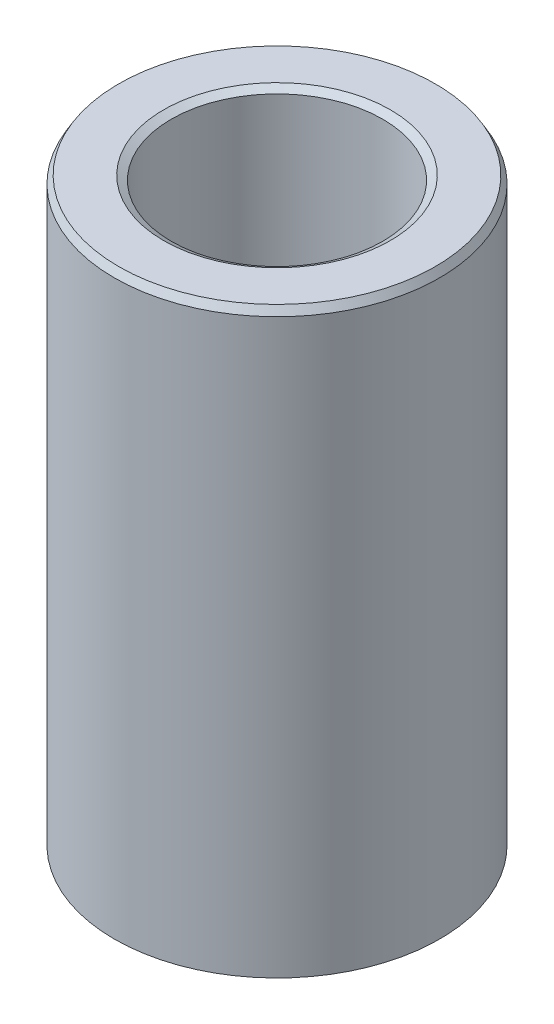
ISO-10303-21;
HEADER;
FILE_DESCRIPTION(('STEP AP214'),'2;1');
FILE_NAME('part.step','',(''),(''),'','','');
FILE_SCHEMA(('AUTOMOTIVE_DESIGN { 1 0 10303 214 1 1 1 1 }'));
ENDSEC;
DATA;
#1=APPLICATION_CONTEXT('core data for automotive mechanical design processes');
#2=APPLICATION_PROTOCOL_DEFINITION('international standard','automotive_design',2000,#1);
#3=PRODUCT_CONTEXT('',#1,'mechanical');
#4=PRODUCT('Part','Part','',(#3));
#5=PRODUCT_RELATED_PRODUCT_CATEGORY('part','',(#4));
#6=PRODUCT_DEFINITION_FORMATION('','',#4);
#7=PRODUCT_DEFINITION_CONTEXT('part definition',#1,'design');
#8=PRODUCT_DEFINITION('design','',#6,#7);
#9=PRODUCT_DEFINITION_SHAPE('','',#8);
#10=(LENGTH_UNIT() NAMED_UNIT(*) SI_UNIT(.MILLI.,.METRE.));
#11=(NAMED_UNIT(*) PLANE_ANGLE_UNIT() SI_UNIT($,.RADIAN.));
#12=(NAMED_UNIT(*) SI_UNIT($,.STERADIAN.) SOLID_ANGLE_UNIT());
#13=UNCERTAINTY_MEASURE_WITH_UNIT(LENGTH_MEASURE(1.E-05),#10,'distance_accuracy_value','');
#14=(GEOMETRIC_REPRESENTATION_CONTEXT(3) GLOBAL_UNCERTAINTY_ASSIGNED_CONTEXT((#13)) GLOBAL_UNIT_ASSIGNED_CONTEXT((#10,
#11,#12)) REPRESENTATION_CONTEXT('',''));
#15=CARTESIAN_POINT('',(0.,0.,0.));
#16=DIRECTION('',(0.,0.,1.));
#17=DIRECTION('',(1.,0.,0.));
#18=AXIS2_PLACEMENT_3D('',#15,#16,#17);
#19=CARTESIAN_POINT('',(0.,179.683679776674,0.));
#20=DIRECTION('',(0.,-1.,0.));
#21=DIRECTION('',(0.,0.,-1.));
#22=AXIS2_PLACEMENT_3D('',#19,#20,#21);
#23=CYLINDRICAL_SURFACE('',#22,50.);
#24=CARTESIAN_POINT('',(0.,1.34464653998601,0.));
#25=DIRECTION('',(0.,1.,0.));
#26=DIRECTION('',(0.,0.,1.));
#27=AXIS2_PLACEMENT_3D('',#24,#25,#26);
#28=CIRCLE('',#27,50.);
#29=CARTESIAN_POINT('',(0.,1.34464653998601,50.));
#30=VERTEX_POINT('',#29);
#31=EDGE_CURVE('E10',#30,#30,#28,.T.);
#32=ORIENTED_EDGE('',*,*,#31,.T.);
#33=EDGE_LOOP('',(#32));
#34=FACE_BOUND('',#33,.T.);
#35=CARTESIAN_POINT('',(0.,177.354683651197,0.));
#36=DIRECTION('',(0.,1.,0.));
#37=DIRECTION('',(0.,0.,1.));
#38=AXIS2_PLACEMENT_3D('',#35,#36,#37);
#39=CIRCLE('',#38,50.);
#40=CARTESIAN_POINT('',(0.,177.354683651197,50.));
#41=VERTEX_POINT('',#40);
#42=EDGE_CURVE('E50',#41,#41,#39,.F.);
#43=ORIENTED_EDGE('',*,*,#42,.T.);
#44=EDGE_LOOP('',(#43));
#45=FACE_BOUND('',#44,.T.);
#46=ADVANCED_FACE('F39',(#34,#45),#23,.T.);
#47=CARTESIAN_POINT('',(0.,179.683679776674,0.));
#48=DIRECTION('',(0.,1.,0.));
#49=DIRECTION('',(0.,0.,1.));
#50=AXIS2_PLACEMENT_3D('',#47,#48,#49);
#51=PLANE('',#50);
#52=CARTESIAN_POINT('',(0.,179.683679776674,0.));
#53=DIRECTION('',(0.,1.,0.));
#54=DIRECTION('',(0.,0.,1.));
#55=AXIS2_PLACEMENT_3D('',#52,#53,#54);
#56=CIRCLE('',#55,34.8423482622935);
#57=CARTESIAN_POINT('',(0.,179.683679776674,34.8423482622935));
#58=VERTEX_POINT('',#57);
#59=EDGE_CURVE('E58',#58,#58,#56,.F.);
#60=ORIENTED_EDGE('',*,*,#59,.T.);
#61=EDGE_LOOP('',(#60));
#62=FACE_BOUND('',#61,.T.);
#63=CARTESIAN_POINT('',(0.,179.683679776674,0.));
#64=DIRECTION('',(0.,1.,0.));
#65=DIRECTION('',(0.,0.,1.));
#66=AXIS2_PLACEMENT_3D('',#63,#64,#65);
#67=CIRCLE('',#66,48.655353460014);
#68=CARTESIAN_POINT('',(0.,179.683679776674,48.655353460014));
#69=VERTEX_POINT('',#68);
#70=EDGE_CURVE('E61',#69,#69,#67,.T.);
#71=ORIENTED_EDGE('',*,*,#70,.T.);
#72=EDGE_LOOP('',(#71));
#73=FACE_BOUND('',#72,.T.);
#74=ADVANCED_FACE('F88',(#62,#73),#51,.T.);
#75=CARTESIAN_POINT('',(0.,0.,0.));
#76=DIRECTION('',(0.,1.,0.));
#77=DIRECTION('',(0.,0.,1.));
#78=AXIS2_PLACEMENT_3D('',#75,#76,#77);
#79=PLANE('',#78);
#80=CARTESIAN_POINT('',(0.,0.,0.));
#81=DIRECTION('',(0.,1.,0.));
#82=DIRECTION('',(0.,0.,1.));
#83=AXIS2_PLACEMENT_3D('',#80,#81,#82);
#84=CIRCLE('',#83,33.8579986768021);
#85=CARTESIAN_POINT('',(0.,0.,33.8579986768021));
#86=VERTEX_POINT('',#85);
#87=EDGE_CURVE('E51',#86,#86,#84,.T.);
#88=ORIENTED_EDGE('',*,*,#87,.T.);
#89=EDGE_LOOP('',(#88));
#90=FACE_BOUND('',#89,.T.);
#91=CARTESIAN_POINT('',(0.,0.,0.));
#92=DIRECTION('',(0.,1.,0.));
#93=DIRECTION('',(0.,0.,1.));
#94=AXIS2_PLACEMENT_3D('',#91,#92,#93);
#95=CIRCLE('',#94,47.6710038745226);
#96=CARTESIAN_POINT('',(0.,0.,47.6710038745226));
#97=VERTEX_POINT('',#96);
#98=EDGE_CURVE('E54',#97,#97,#95,.F.);
#99=ORIENTED_EDGE('',*,*,#98,.T.);
#100=EDGE_LOOP('',(#99));
#101=FACE_BOUND('',#100,.T.);
#102=ADVANCED_FACE('F83',(#90,#101),#79,.F.);
#103=CARTESIAN_POINT('',(0.,179.683679776674,0.));
#104=DIRECTION('',(0.,-1.,0.));
#105=DIRECTION('',(0.,0.,-1.));
#106=AXIS2_PLACEMENT_3D('',#103,#104,#105);
#107=CYLINDRICAL_SURFACE('',#106,32.5133521368161);
#108=CARTESIAN_POINT('',(0.,178.339033236688,0.));
#109=DIRECTION('',(0.,1.,0.));
#110=DIRECTION('',(0.,0.,1.));
#111=AXIS2_PLACEMENT_3D('',#108,#109,#110);
#112=CIRCLE('',#111,32.5133521368161);
#113=CARTESIAN_POINT('',(0.,178.339033236688,32.5133521368161));
#114=VERTEX_POINT('',#113);
#115=EDGE_CURVE('E67',#114,#114,#112,.T.);
#116=ORIENTED_EDGE('',*,*,#115,.T.);
#117=EDGE_LOOP('',(#116));
#118=FACE_BOUND('',#117,.T.);
#119=CARTESIAN_POINT('',(0.,2.32899612547743,0.));
#120=DIRECTION('',(0.,1.,0.));
#121=DIRECTION('',(0.,0.,1.));
#122=AXIS2_PLACEMENT_3D('',#119,#120,#121);
#123=CIRCLE('',#122,32.5133521368161);
#124=CARTESIAN_POINT('',(0.,2.32899612547743,32.5133521368161));
#125=VERTEX_POINT('',#124);
#126=EDGE_CURVE('E69',#125,#125,#123,.F.);
#127=ORIENTED_EDGE('',*,*,#126,.T.);
#128=EDGE_LOOP('',(#127));
#129=FACE_BOUND('',#128,.T.);
#130=ADVANCED_FACE('F71',(#118,#129),#107,.F.);
#131=CARTESIAN_POINT('',(0.,178.339033236688,0.));
#132=DIRECTION('',(0.,1.,0.));
#133=DIRECTION('',(0.,0.,1.));
#134=AXIS2_PLACEMENT_3D('',#131,#132,#133);
#135=CONICAL_SURFACE('',#134,32.5133521368161,1.0471975511966);
#136=ORIENTED_EDGE('',*,*,#59,.F.);
#137=EDGE_LOOP('',(#136));
#138=FACE_BOUND('',#137,.T.);
#139=ORIENTED_EDGE('',*,*,#115,.F.);
#140=EDGE_LOOP('',(#139));
#141=FACE_BOUND('',#140,.T.);
#142=ADVANCED_FACE('F77',(#138,#141),#135,.F.);
#143=CARTESIAN_POINT('',(0.,0.,0.));
#144=DIRECTION('',(0.,-1.,0.));
#145=DIRECTION('',(0.,0.,-1.));
#146=AXIS2_PLACEMENT_3D('',#143,#144,#145);
#147=CONICAL_SURFACE('',#146,33.8579986768021,0.523598775598299);
#148=ORIENTED_EDGE('',*,*,#126,.F.);
#149=EDGE_LOOP('',(#148));
#150=FACE_BOUND('',#149,.T.);
#151=ORIENTED_EDGE('',*,*,#87,.F.);
#152=EDGE_LOOP('',(#151));
#153=FACE_BOUND('',#152,.T.);
#154=ADVANCED_FACE('F73',(#150,#153),#147,.F.);
#155=CARTESIAN_POINT('',(0.,1.34464653998601,0.));
#156=DIRECTION('',(0.,1.,0.));
#157=DIRECTION('',(0.,0.,1.));
#158=AXIS2_PLACEMENT_3D('',#155,#156,#157);
#159=CONICAL_SURFACE('',#158,50.,1.0471975511966);
#160=ORIENTED_EDGE('',*,*,#98,.F.);
#161=EDGE_LOOP('',(#160));
#162=FACE_BOUND('',#161,.T.);
#163=ORIENTED_EDGE('',*,*,#31,.F.);
#164=EDGE_LOOP('',(#163));
#165=FACE_BOUND('',#164,.T.);
#166=ADVANCED_FACE('F76',(#162,#165),#159,.T.);
#167=CARTESIAN_POINT('',(0.,179.683679776674,0.));
#168=DIRECTION('',(0.,-1.,0.));
#169=DIRECTION('',(0.,0.,-1.));
#170=AXIS2_PLACEMENT_3D('',#167,#168,#169);
#171=CONICAL_SURFACE('',#170,48.655353460014,0.523598775598302);
#172=ORIENTED_EDGE('',*,*,#42,.F.);
#173=EDGE_LOOP('',(#172));
#174=FACE_BOUND('',#173,.T.);
#175=ORIENTED_EDGE('',*,*,#70,.F.);
#176=EDGE_LOOP('',(#175));
#177=FACE_BOUND('',#176,.T.);
#178=ADVANCED_FACE('F45',(#174,#177),#171,.T.);
#179=CLOSED_SHELL('',(#46,#74,#102,#130,#142,#154,#166,#178));
#180=MANIFOLD_SOLID_BREP('B2',#179);
#181=ADVANCED_BREP_SHAPE_REPRESENTATION('',(#18,#180),#14);
#182=SHAPE_DEFINITION_REPRESENTATION(#9,#181);
ENDSEC;
END-ISO-10303-21;
